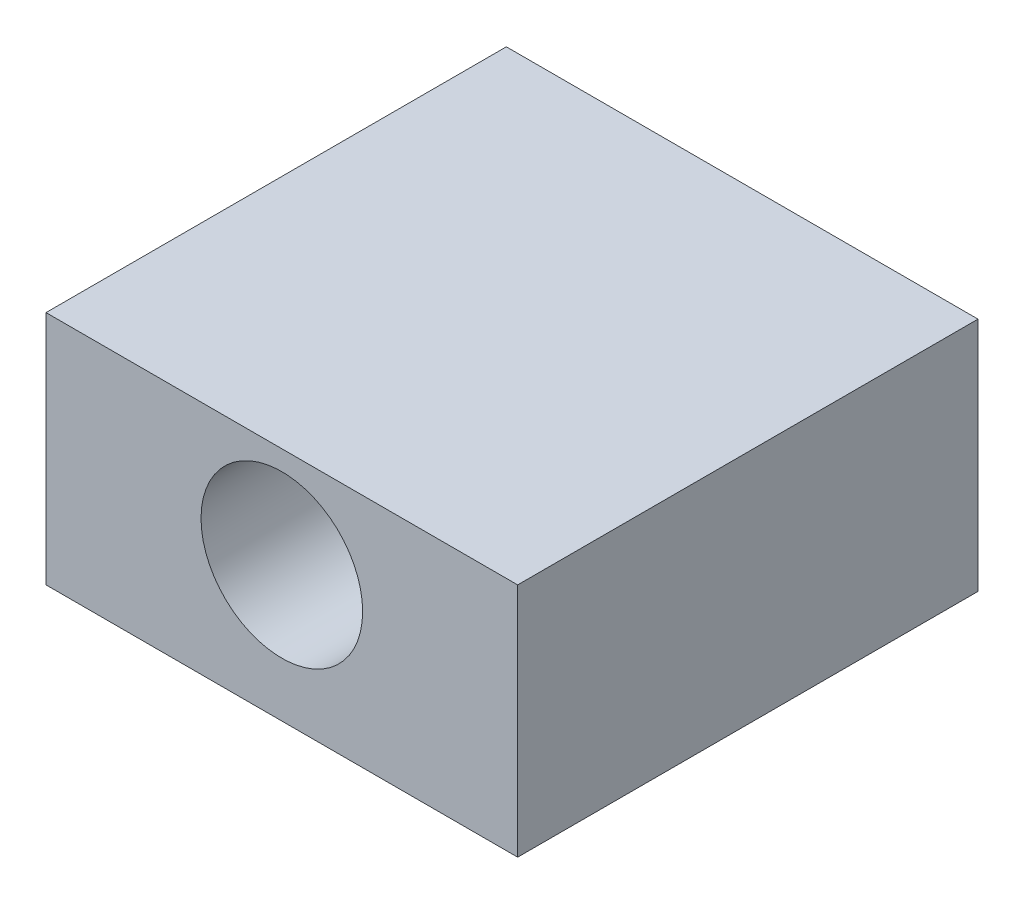
ISO-10303-21;
HEADER;
FILE_DESCRIPTION(('STEP AP214'),'2;1');
FILE_NAME('part.step','',(''),(''),'','','');
FILE_SCHEMA(('AUTOMOTIVE_DESIGN { 1 0 10303 214 1 1 1 1 }'));
ENDSEC;
DATA;
#1=APPLICATION_CONTEXT('core data for automotive mechanical design processes');
#2=APPLICATION_PROTOCOL_DEFINITION('international standard','automotive_design',2000,#1);
#3=PRODUCT_CONTEXT('',#1,'mechanical');
#4=PRODUCT('Part','Part','',(#3));
#5=PRODUCT_RELATED_PRODUCT_CATEGORY('part','',(#4));
#6=PRODUCT_DEFINITION_FORMATION('','',#4);
#7=PRODUCT_DEFINITION_CONTEXT('part definition',#1,'design');
#8=PRODUCT_DEFINITION('design','',#6,#7);
#9=PRODUCT_DEFINITION_SHAPE('','',#8);
#10=(LENGTH_UNIT() NAMED_UNIT(*) SI_UNIT(.MILLI.,.METRE.));
#11=(NAMED_UNIT(*) PLANE_ANGLE_UNIT() SI_UNIT($,.RADIAN.));
#12=(NAMED_UNIT(*) SI_UNIT($,.STERADIAN.) SOLID_ANGLE_UNIT());
#13=UNCERTAINTY_MEASURE_WITH_UNIT(LENGTH_MEASURE(1.E-05),#10,'distance_accuracy_value','');
#14=(GEOMETRIC_REPRESENTATION_CONTEXT(3) GLOBAL_UNCERTAINTY_ASSIGNED_CONTEXT((#13)) GLOBAL_UNIT_ASSIGNED_CONTEXT((#10,
#11,#12)) REPRESENTATION_CONTEXT('',''));
#15=CARTESIAN_POINT('',(0.,0.,0.));
#16=DIRECTION('',(0.,0.,1.));
#17=DIRECTION('',(1.,0.,0.));
#18=AXIS2_PLACEMENT_3D('',#15,#16,#17);
#19=CARTESIAN_POINT('',(9.525,-4.7625,18.5928));
#20=DIRECTION('',(-1.,0.,0.));
#21=DIRECTION('',(0.,0.,1.));
#22=AXIS2_PLACEMENT_3D('',#19,#20,#21);
#23=PLANE('',#22);
#24=DIRECTION('',(0.,1.,0.));
#25=VECTOR('',#24,1.);
#26=CARTESIAN_POINT('',(9.525,-4.7625,0.));
#27=LINE('',#26,#25);
#28=CARTESIAN_POINT('',(9.525,-4.7625,0.));
#29=VERTEX_POINT('',#28);
#30=CARTESIAN_POINT('',(9.525,4.7625,0.));
#31=VERTEX_POINT('',#30);
#32=EDGE_CURVE('E95',#29,#31,#27,.T.);
#33=ORIENTED_EDGE('',*,*,#32,.T.);
#34=DIRECTION('',(0.,0.,-1.));
#35=VECTOR('',#34,1.);
#36=CARTESIAN_POINT('',(9.525,4.7625,18.5928));
#37=LINE('',#36,#35);
#38=CARTESIAN_POINT('',(9.525,4.7625,18.5928));
#39=VERTEX_POINT('',#38);
#40=EDGE_CURVE('E11',#39,#31,#37,.T.);
#41=ORIENTED_EDGE('',*,*,#40,.F.);
#42=DIRECTION('',(0.,1.,0.));
#43=VECTOR('',#42,1.);
#44=CARTESIAN_POINT('',(9.525,-4.7625,18.5928));
#45=LINE('',#44,#43);
#46=CARTESIAN_POINT('',(9.525,-4.7625,18.5928));
#47=VERTEX_POINT('',#46);
#48=EDGE_CURVE('E104',#47,#39,#45,.T.);
#49=ORIENTED_EDGE('',*,*,#48,.F.);
#50=DIRECTION('',(0.,0.,-1.));
#51=VECTOR('',#50,1.);
#52=CARTESIAN_POINT('',(9.525,-4.7625,18.5928));
#53=LINE('',#52,#51);
#54=EDGE_CURVE('E109',#47,#29,#53,.T.);
#55=ORIENTED_EDGE('',*,*,#54,.T.);
#56=EDGE_LOOP('',(#33,#41,#49,#55));
#57=FACE_BOUND('',#56,.T.);
#58=ADVANCED_FACE('F34',(#57),#23,.F.);
#59=CARTESIAN_POINT('',(-9.525,4.7625,18.5928));
#60=DIRECTION('',(0.,-1.,0.));
#61=DIRECTION('',(0.,0.,-1.));
#62=AXIS2_PLACEMENT_3D('',#59,#60,#61);
#63=PLANE('',#62);
#64=DIRECTION('',(-1.,0.,0.));
#65=VECTOR('',#64,1.);
#66=CARTESIAN_POINT('',(-9.525,4.7625,0.));
#67=LINE('',#66,#65);
#68=CARTESIAN_POINT('',(-9.525,4.7625,0.));
#69=VERTEX_POINT('',#68);
#70=EDGE_CURVE('E99',#31,#69,#67,.T.);
#71=ORIENTED_EDGE('',*,*,#70,.T.);
#72=DIRECTION('',(0.,0.,-1.));
#73=VECTOR('',#72,1.);
#74=CARTESIAN_POINT('',(-9.525,4.7625,18.5928));
#75=LINE('',#74,#73);
#76=CARTESIAN_POINT('',(-9.525,4.7625,18.5928));
#77=VERTEX_POINT('',#76);
#78=EDGE_CURVE('E42',#77,#69,#75,.T.);
#79=ORIENTED_EDGE('',*,*,#78,.F.);
#80=DIRECTION('',(-1.,0.,0.));
#81=VECTOR('',#80,1.);
#82=CARTESIAN_POINT('',(-9.525,4.7625,18.5928));
#83=LINE('',#82,#81);
#84=EDGE_CURVE('E81',#39,#77,#83,.T.);
#85=ORIENTED_EDGE('',*,*,#84,.F.);
#86=ORIENTED_EDGE('',*,*,#40,.T.);
#87=EDGE_LOOP('',(#71,#79,#85,#86));
#88=FACE_BOUND('',#87,.T.);
#89=ADVANCED_FACE('F133',(#88),#63,.F.);
#90=CARTESIAN_POINT('',(-9.525,-4.7625,18.5928));
#91=DIRECTION('',(1.,0.,0.));
#92=DIRECTION('',(0.,0.,-1.));
#93=AXIS2_PLACEMENT_3D('',#90,#91,#92);
#94=PLANE('',#93);
#95=DIRECTION('',(0.,-1.,0.));
#96=VECTOR('',#95,1.);
#97=CARTESIAN_POINT('',(-9.525,-4.7625,0.));
#98=LINE('',#97,#96);
#99=CARTESIAN_POINT('',(-9.525,-4.7625,0.));
#100=VERTEX_POINT('',#99);
#101=EDGE_CURVE('E68',#69,#100,#98,.T.);
#102=ORIENTED_EDGE('',*,*,#101,.T.);
#103=DIRECTION('',(0.,0.,-1.));
#104=VECTOR('',#103,1.);
#105=CARTESIAN_POINT('',(-9.525,-4.7625,18.5928));
#106=LINE('',#105,#104);
#107=CARTESIAN_POINT('',(-9.525,-4.7625,18.5928));
#108=VERTEX_POINT('',#107);
#109=EDGE_CURVE('E115',#108,#100,#106,.T.);
#110=ORIENTED_EDGE('',*,*,#109,.F.);
#111=DIRECTION('',(0.,-1.,0.));
#112=VECTOR('',#111,1.);
#113=CARTESIAN_POINT('',(-9.525,-4.7625,18.5928));
#114=LINE('',#113,#112);
#115=EDGE_CURVE('E107',#77,#108,#114,.T.);
#116=ORIENTED_EDGE('',*,*,#115,.F.);
#117=ORIENTED_EDGE('',*,*,#78,.T.);
#118=EDGE_LOOP('',(#102,#110,#116,#117));
#119=FACE_BOUND('',#118,.T.);
#120=ADVANCED_FACE('F117',(#119),#94,.F.);
#121=CARTESIAN_POINT('',(-9.525,-4.7625,18.5928));
#122=DIRECTION('',(0.,1.,0.));
#123=DIRECTION('',(0.,0.,1.));
#124=AXIS2_PLACEMENT_3D('',#121,#122,#123);
#125=PLANE('',#124);
#126=DIRECTION('',(1.,0.,0.));
#127=VECTOR('',#126,1.);
#128=CARTESIAN_POINT('',(-9.525,-4.7625,0.));
#129=LINE('',#128,#127);
#130=EDGE_CURVE('E74',#100,#29,#129,.T.);
#131=ORIENTED_EDGE('',*,*,#130,.T.);
#132=ORIENTED_EDGE('',*,*,#54,.F.);
#133=DIRECTION('',(1.,0.,0.));
#134=VECTOR('',#133,1.);
#135=CARTESIAN_POINT('',(-9.525,-4.7625,18.5928));
#136=LINE('',#135,#134);
#137=EDGE_CURVE('E50',#108,#47,#136,.T.);
#138=ORIENTED_EDGE('',*,*,#137,.F.);
#139=ORIENTED_EDGE('',*,*,#109,.T.);
#140=EDGE_LOOP('',(#131,#132,#138,#139));
#141=FACE_BOUND('',#140,.T.);
#142=ADVANCED_FACE('F123',(#141),#125,.F.);
#143=CARTESIAN_POINT('',(9.525,4.7625,18.5928));
#144=DIRECTION('',(0.,0.,-1.));
#145=DIRECTION('',(-1.,0.,0.));
#146=AXIS2_PLACEMENT_3D('',#143,#144,#145);
#147=PLANE('',#146);
#148=CARTESIAN_POINT('',(0.,0.6985,18.5928));
#149=DIRECTION('',(0.,0.,1.));
#150=DIRECTION('',(1.,0.,0.));
#151=AXIS2_PLACEMENT_3D('',#148,#149,#150);
#152=CIRCLE('',#151,3.2639);
#153=CARTESIAN_POINT('',(3.2639,0.6985,18.5928));
#154=VERTEX_POINT('',#153);
#155=EDGE_CURVE('E96',#154,#154,#152,.T.);
#156=ORIENTED_EDGE('',*,*,#155,.F.);
#157=EDGE_LOOP('',(#156));
#158=FACE_BOUND('',#157,.T.);
#159=ORIENTED_EDGE('',*,*,#48,.T.);
#160=ORIENTED_EDGE('',*,*,#84,.T.);
#161=ORIENTED_EDGE('',*,*,#115,.T.);
#162=ORIENTED_EDGE('',*,*,#137,.T.);
#163=EDGE_LOOP('',(#159,#160,#161,#162));
#164=FACE_BOUND('',#163,.T.);
#165=ADVANCED_FACE('F125',(#158,#164),#147,.F.);
#166=CARTESIAN_POINT('',(9.525,4.7625,0.));
#167=DIRECTION('',(0.,0.,-1.));
#168=DIRECTION('',(-1.,0.,0.));
#169=AXIS2_PLACEMENT_3D('',#166,#167,#168);
#170=PLANE('',#169);
#171=ORIENTED_EDGE('',*,*,#32,.F.);
#172=ORIENTED_EDGE('',*,*,#130,.F.);
#173=ORIENTED_EDGE('',*,*,#101,.F.);
#174=ORIENTED_EDGE('',*,*,#70,.F.);
#175=EDGE_LOOP('',(#171,#172,#173,#174));
#176=FACE_BOUND('',#175,.T.);
#177=ADVANCED_FACE('F89',(#176),#170,.T.);
#178=CARTESIAN_POINT('',(0.,0.6985,3.3528));
#179=DIRECTION('',(0.,0.,1.));
#180=DIRECTION('',(1.,0.,0.));
#181=AXIS2_PLACEMENT_3D('',#178,#179,#180);
#182=CONICAL_SURFACE('',#181,3.2639,1.02974425867665);
#183=CARTESIAN_POINT('',(0.,0.6985,1.39165102555595));
#184=VERTEX_POINT('',#183);
#185=VERTEX_LOOP('',#184);
#186=FACE_BOUND('',#185,.T.);
#187=CARTESIAN_POINT('',(0.,0.6985,3.3528));
#188=DIRECTION('',(0.,0.,1.));
#189=DIRECTION('',(1.,0.,0.));
#190=AXIS2_PLACEMENT_3D('',#187,#188,#189);
#191=CIRCLE('',#190,3.2639);
#192=CARTESIAN_POINT('',(3.2639,0.6985,3.3528));
#193=VERTEX_POINT('',#192);
#194=EDGE_CURVE('E93',#193,#193,#191,.T.);
#195=ORIENTED_EDGE('',*,*,#194,.T.);
#196=EDGE_LOOP('',(#195));
#197=FACE_BOUND('',#196,.T.);
#198=ADVANCED_FACE('F85',(#186,#197),#182,.F.);
#199=CARTESIAN_POINT('',(0.,0.6985,18.5928));
#200=DIRECTION('',(0.,0.,1.));
#201=DIRECTION('',(1.,0.,0.));
#202=AXIS2_PLACEMENT_3D('',#199,#200,#201);
#203=CYLINDRICAL_SURFACE('',#202,3.2639);
#204=ORIENTED_EDGE('',*,*,#194,.F.);
#205=EDGE_LOOP('',(#204));
#206=FACE_BOUND('',#205,.T.);
#207=ORIENTED_EDGE('',*,*,#155,.T.);
#208=EDGE_LOOP('',(#207));
#209=FACE_BOUND('',#208,.T.);
#210=ADVANCED_FACE('F88',(#206,#209),#203,.F.);
#211=CLOSED_SHELL('',(#58,#89,#120,#142,#165,#177,#198,#210));
#212=MANIFOLD_SOLID_BREP('B2',#211);
#213=ADVANCED_BREP_SHAPE_REPRESENTATION('',(#18,#212),#14);
#214=SHAPE_DEFINITION_REPRESENTATION(#9,#213);
ENDSEC;
END-ISO-10303-21;
